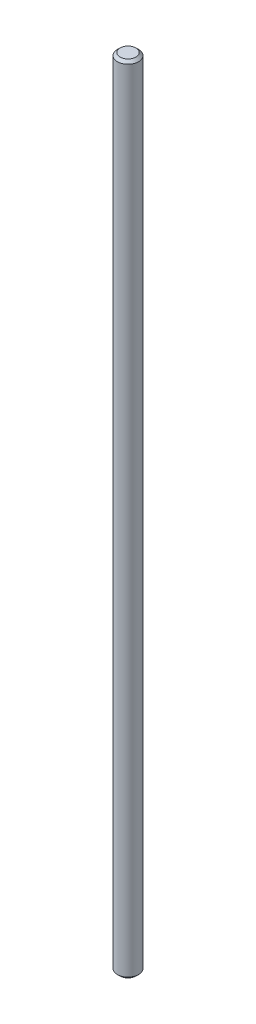
ISO-10303-21;
HEADER;
FILE_DESCRIPTION(('STEP AP214'),'2;1');
FILE_NAME('part.step','',(''),(''),'','','');
FILE_SCHEMA(('AUTOMOTIVE_DESIGN { 1 0 10303 214 1 1 1 1 }'));
ENDSEC;
DATA;
#1=APPLICATION_CONTEXT('core data for automotive mechanical design processes');
#2=APPLICATION_PROTOCOL_DEFINITION('international standard','automotive_design',2000,#1);
#3=PRODUCT_CONTEXT('',#1,'mechanical');
#4=PRODUCT('Part','Part','',(#3));
#5=PRODUCT_RELATED_PRODUCT_CATEGORY('part','',(#4));
#6=PRODUCT_DEFINITION_FORMATION('','',#4);
#7=PRODUCT_DEFINITION_CONTEXT('part definition',#1,'design');
#8=PRODUCT_DEFINITION('design','',#6,#7);
#9=PRODUCT_DEFINITION_SHAPE('','',#8);
#10=(LENGTH_UNIT() NAMED_UNIT(*) SI_UNIT(.MILLI.,.METRE.));
#11=(NAMED_UNIT(*) PLANE_ANGLE_UNIT() SI_UNIT($,.RADIAN.));
#12=(NAMED_UNIT(*) SI_UNIT($,.STERADIAN.) SOLID_ANGLE_UNIT());
#13=UNCERTAINTY_MEASURE_WITH_UNIT(LENGTH_MEASURE(1.E-05),#10,'distance_accuracy_value','');
#14=(GEOMETRIC_REPRESENTATION_CONTEXT(3) GLOBAL_UNCERTAINTY_ASSIGNED_CONTEXT((#13)) GLOBAL_UNIT_ASSIGNED_CONTEXT((#10,
#11,#12)) REPRESENTATION_CONTEXT('',''));
#15=CARTESIAN_POINT('',(0.,0.,0.));
#16=DIRECTION('',(0.,0.,1.));
#17=DIRECTION('',(1.,0.,0.));
#18=AXIS2_PLACEMENT_3D('',#15,#16,#17);
#19=CARTESIAN_POINT('',(0.,300.,0.));
#20=DIRECTION('',(0.,-1.,0.));
#21=DIRECTION('',(0.,0.,-1.));
#22=AXIS2_PLACEMENT_3D('',#19,#20,#21);
#23=CYLINDRICAL_SURFACE('',#22,4.);
#24=CARTESIAN_POINT('',(0.,1.00000000000006,0.));
#25=DIRECTION('',(0.,1.,0.));
#26=DIRECTION('',(0.,0.,1.));
#27=AXIS2_PLACEMENT_3D('',#24,#25,#26);
#28=CIRCLE('',#27,4.);
#29=CARTESIAN_POINT('',(0.,1.00000000000006,4.));
#30=VERTEX_POINT('',#29);
#31=EDGE_CURVE('E48',#30,#30,#28,.T.);
#32=ORIENTED_EDGE('',*,*,#31,.T.);
#33=EDGE_LOOP('',(#32));
#34=FACE_BOUND('',#33,.T.);
#35=CARTESIAN_POINT('',(0.,299.,0.));
#36=DIRECTION('',(0.,1.,0.));
#37=DIRECTION('',(0.,0.,1.));
#38=AXIS2_PLACEMENT_3D('',#35,#36,#37);
#39=CIRCLE('',#38,4.);
#40=CARTESIAN_POINT('',(0.,299.,4.));
#41=VERTEX_POINT('',#40);
#42=EDGE_CURVE('E52',#41,#41,#39,.F.);
#43=ORIENTED_EDGE('',*,*,#42,.T.);
#44=EDGE_LOOP('',(#43));
#45=FACE_BOUND('',#44,.T.);
#46=ADVANCED_FACE('F36',(#34,#45),#23,.T.);
#47=CARTESIAN_POINT('',(0.,300.,0.));
#48=DIRECTION('',(0.,1.,0.));
#49=DIRECTION('',(0.,0.,1.));
#50=AXIS2_PLACEMENT_3D('',#47,#48,#49);
#51=PLANE('',#50);
#52=CARTESIAN_POINT('',(0.,300.,0.));
#53=DIRECTION('',(0.,1.,0.));
#54=DIRECTION('',(0.,0.,1.));
#55=AXIS2_PLACEMENT_3D('',#52,#53,#54);
#56=CIRCLE('',#55,2.99999999999998);
#57=CARTESIAN_POINT('',(0.,300.,2.99999999999998));
#58=VERTEX_POINT('',#57);
#59=EDGE_CURVE('E10',#58,#58,#56,.T.);
#60=ORIENTED_EDGE('',*,*,#59,.T.);
#61=EDGE_LOOP('',(#60));
#62=FACE_BOUND('',#61,.T.);
#63=ADVANCED_FACE('F68',(#62),#51,.T.);
#64=CARTESIAN_POINT('',(0.,0.,0.));
#65=DIRECTION('',(0.,1.,0.));
#66=DIRECTION('',(0.,0.,1.));
#67=AXIS2_PLACEMENT_3D('',#64,#65,#66);
#68=PLANE('',#67);
#69=CARTESIAN_POINT('',(0.,0.,0.));
#70=DIRECTION('',(0.,1.,0.));
#71=DIRECTION('',(0.,0.,1.));
#72=AXIS2_PLACEMENT_3D('',#69,#70,#71);
#73=CIRCLE('',#72,2.99999999999992);
#74=CARTESIAN_POINT('',(0.,0.,2.99999999999992));
#75=VERTEX_POINT('',#74);
#76=EDGE_CURVE('E44',#75,#75,#73,.F.);
#77=ORIENTED_EDGE('',*,*,#76,.T.);
#78=EDGE_LOOP('',(#77));
#79=FACE_BOUND('',#78,.T.);
#80=ADVANCED_FACE('F65',(#79),#68,.F.);
#81=CARTESIAN_POINT('',(0.,1.00000000000006,0.));
#82=DIRECTION('',(0.,1.,0.));
#83=DIRECTION('',(0.,0.,1.));
#84=AXIS2_PLACEMENT_3D('',#81,#82,#83);
#85=CONICAL_SURFACE('',#84,4.,0.78539816339746);
#86=ORIENTED_EDGE('',*,*,#76,.F.);
#87=EDGE_LOOP('',(#86));
#88=FACE_BOUND('',#87,.T.);
#89=ORIENTED_EDGE('',*,*,#31,.F.);
#90=EDGE_LOOP('',(#89));
#91=FACE_BOUND('',#90,.T.);
#92=ADVANCED_FACE('F61',(#88,#91),#85,.T.);
#93=CARTESIAN_POINT('',(0.,300.,0.));
#94=DIRECTION('',(0.,-1.,0.));
#95=DIRECTION('',(0.,0.,-1.));
#96=AXIS2_PLACEMENT_3D('',#93,#94,#95);
#97=CONICAL_SURFACE('',#96,2.99999999999998,0.78539816339746);
#98=ORIENTED_EDGE('',*,*,#42,.F.);
#99=EDGE_LOOP('',(#98));
#100=FACE_BOUND('',#99,.T.);
#101=ORIENTED_EDGE('',*,*,#59,.F.);
#102=EDGE_LOOP('',(#101));
#103=FACE_BOUND('',#102,.T.);
#104=ADVANCED_FACE('F39',(#100,#103),#97,.T.);
#105=CLOSED_SHELL('',(#46,#63,#80,#92,#104));
#106=MANIFOLD_SOLID_BREP('B2',#105);
#107=ADVANCED_BREP_SHAPE_REPRESENTATION('',(#18,#106),#14);
#108=SHAPE_DEFINITION_REPRESENTATION(#9,#107);
ENDSEC;
END-ISO-10303-21;
